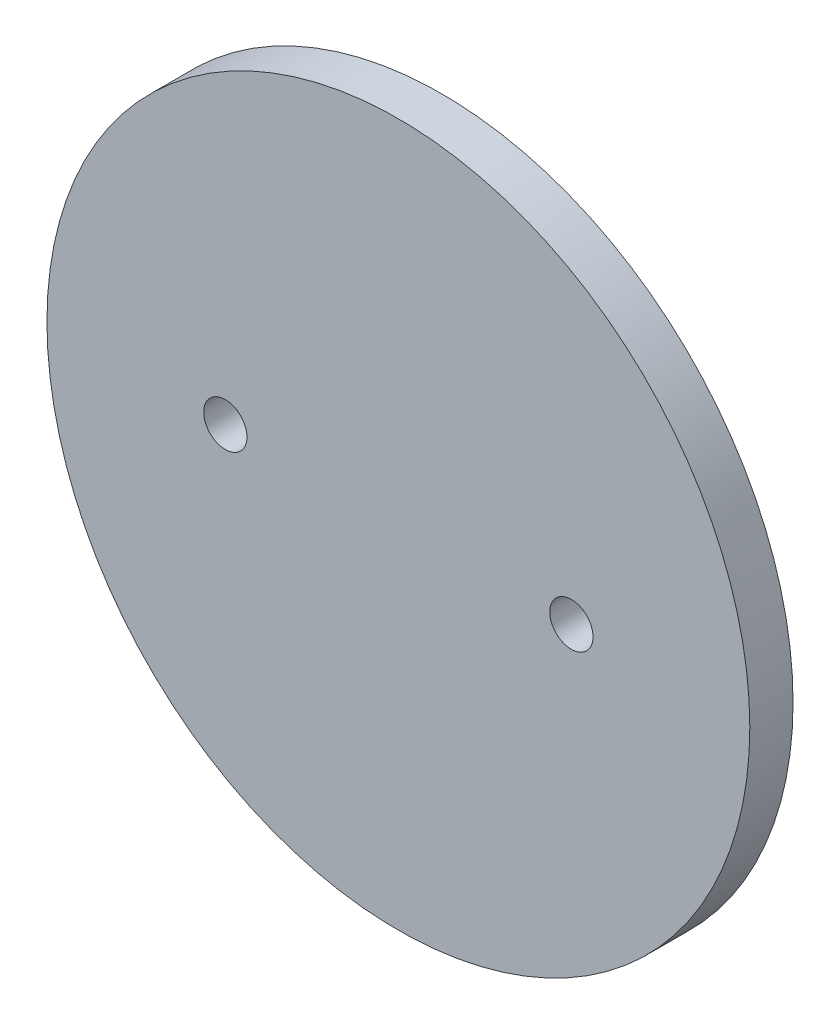
ISO-10303-21;
HEADER;
FILE_DESCRIPTION(('STEP AP214'),'2;1');
FILE_NAME('part.step','',(''),(''),'','','');
FILE_SCHEMA(('AUTOMOTIVE_DESIGN { 1 0 10303 214 1 1 1 1 }'));
ENDSEC;
DATA;
#1=APPLICATION_CONTEXT('core data for automotive mechanical design processes');
#2=APPLICATION_PROTOCOL_DEFINITION('international standard','automotive_design',2000,#1);
#3=PRODUCT_CONTEXT('',#1,'mechanical');
#4=PRODUCT('Part','Part','',(#3));
#5=PRODUCT_RELATED_PRODUCT_CATEGORY('part','',(#4));
#6=PRODUCT_DEFINITION_FORMATION('','',#4);
#7=PRODUCT_DEFINITION_CONTEXT('part definition',#1,'design');
#8=PRODUCT_DEFINITION('design','',#6,#7);
#9=PRODUCT_DEFINITION_SHAPE('','',#8);
#10=(LENGTH_UNIT() NAMED_UNIT(*) SI_UNIT(.MILLI.,.METRE.));
#11=(NAMED_UNIT(*) PLANE_ANGLE_UNIT() SI_UNIT($,.RADIAN.));
#12=(NAMED_UNIT(*) SI_UNIT($,.STERADIAN.) SOLID_ANGLE_UNIT());
#13=UNCERTAINTY_MEASURE_WITH_UNIT(LENGTH_MEASURE(1.E-05),#10,'distance_accuracy_value','');
#14=(GEOMETRIC_REPRESENTATION_CONTEXT(3) GLOBAL_UNCERTAINTY_ASSIGNED_CONTEXT((#13)) GLOBAL_UNIT_ASSIGNED_CONTEXT((#10,
#11,#12)) REPRESENTATION_CONTEXT('',''));
#15=CARTESIAN_POINT('',(0.,0.,0.));
#16=DIRECTION('',(0.,0.,1.));
#17=DIRECTION('',(1.,0.,0.));
#18=AXIS2_PLACEMENT_3D('',#15,#16,#17);
#19=CARTESIAN_POINT('',(0.,0.,2.54));
#20=DIRECTION('',(0.,0.,-1.));
#21=DIRECTION('',(-1.,0.,0.));
#22=AXIS2_PLACEMENT_3D('',#19,#20,#21);
#23=CYLINDRICAL_SURFACE('',#22,20.6375);
#24=CARTESIAN_POINT('',(0.,0.,2.54));
#25=DIRECTION('',(0.,0.,1.));
#26=DIRECTION('',(1.,0.,0.));
#27=AXIS2_PLACEMENT_3D('',#24,#25,#26);
#28=CIRCLE('',#27,20.6375);
#29=CARTESIAN_POINT('',(20.6375,0.,2.54));
#30=VERTEX_POINT('',#29);
#31=EDGE_CURVE('E10',#30,#30,#28,.T.);
#32=ORIENTED_EDGE('',*,*,#31,.F.);
#33=EDGE_LOOP('',(#32));
#34=FACE_BOUND('',#33,.T.);
#35=CARTESIAN_POINT('',(0.,0.,0.));
#36=DIRECTION('',(0.,0.,1.));
#37=DIRECTION('',(1.,0.,0.));
#38=AXIS2_PLACEMENT_3D('',#35,#36,#37);
#39=CIRCLE('',#38,20.6375);
#40=CARTESIAN_POINT('',(20.6375,0.,0.));
#41=VERTEX_POINT('',#40);
#42=EDGE_CURVE('E34',#41,#41,#39,.T.);
#43=ORIENTED_EDGE('',*,*,#42,.T.);
#44=EDGE_LOOP('',(#43));
#45=FACE_BOUND('',#44,.T.);
#46=ADVANCED_FACE('F31',(#34,#45),#23,.T.);
#47=CARTESIAN_POINT('',(0.,0.,2.54));
#48=DIRECTION('',(0.,0.,1.));
#49=DIRECTION('',(1.,0.,0.));
#50=AXIS2_PLACEMENT_3D('',#47,#48,#49);
#51=PLANE('',#50);
#52=CARTESIAN_POINT('',(-10.16,0.,2.54));
#53=DIRECTION('',(0.,0.,1.));
#54=DIRECTION('',(1.,0.,0.));
#55=AXIS2_PLACEMENT_3D('',#52,#53,#54);
#56=CIRCLE('',#55,1.27);
#57=CARTESIAN_POINT('',(-8.89,0.,2.54));
#58=VERTEX_POINT('',#57);
#59=EDGE_CURVE('E49',#58,#58,#56,.T.);
#60=ORIENTED_EDGE('',*,*,#59,.F.);
#61=EDGE_LOOP('',(#60));
#62=FACE_BOUND('',#61,.T.);
#63=CARTESIAN_POINT('',(10.16,0.,2.54));
#64=DIRECTION('',(0.,0.,1.));
#65=DIRECTION('',(1.,0.,0.));
#66=AXIS2_PLACEMENT_3D('',#63,#64,#65);
#67=CIRCLE('',#66,1.27);
#68=CARTESIAN_POINT('',(11.43,0.,2.54));
#69=VERTEX_POINT('',#68);
#70=EDGE_CURVE('E43',#69,#69,#67,.T.);
#71=ORIENTED_EDGE('',*,*,#70,.F.);
#72=EDGE_LOOP('',(#71));
#73=FACE_BOUND('',#72,.T.);
#74=ORIENTED_EDGE('',*,*,#31,.T.);
#75=EDGE_LOOP('',(#74));
#76=FACE_BOUND('',#75,.T.);
#77=ADVANCED_FACE('F65',(#62,#73,#76),#51,.T.);
#78=CARTESIAN_POINT('',(0.,0.,0.));
#79=DIRECTION('',(0.,0.,1.));
#80=DIRECTION('',(1.,0.,0.));
#81=AXIS2_PLACEMENT_3D('',#78,#79,#80);
#82=PLANE('',#81);
#83=CARTESIAN_POINT('',(-10.16,0.,0.));
#84=DIRECTION('',(0.,0.,1.));
#85=DIRECTION('',(1.,0.,0.));
#86=AXIS2_PLACEMENT_3D('',#83,#84,#85);
#87=CIRCLE('',#86,1.27);
#88=CARTESIAN_POINT('',(-8.89,0.,0.));
#89=VERTEX_POINT('',#88);
#90=EDGE_CURVE('E41',#89,#89,#87,.T.);
#91=ORIENTED_EDGE('',*,*,#90,.T.);
#92=EDGE_LOOP('',(#91));
#93=FACE_BOUND('',#92,.T.);
#94=CARTESIAN_POINT('',(10.16,0.,0.));
#95=DIRECTION('',(0.,0.,1.));
#96=DIRECTION('',(1.,0.,0.));
#97=AXIS2_PLACEMENT_3D('',#94,#95,#96);
#98=CIRCLE('',#97,1.27);
#99=CARTESIAN_POINT('',(11.43,0.,0.));
#100=VERTEX_POINT('',#99);
#101=EDGE_CURVE('E46',#100,#100,#98,.T.);
#102=ORIENTED_EDGE('',*,*,#101,.T.);
#103=EDGE_LOOP('',(#102));
#104=FACE_BOUND('',#103,.T.);
#105=ORIENTED_EDGE('',*,*,#42,.F.);
#106=EDGE_LOOP('',(#105));
#107=FACE_BOUND('',#106,.T.);
#108=ADVANCED_FACE('F55',(#93,#104,#107),#82,.F.);
#109=CARTESIAN_POINT('',(10.16,0.,0.));
#110=DIRECTION('',(0.,0.,1.));
#111=DIRECTION('',(1.,0.,0.));
#112=AXIS2_PLACEMENT_3D('',#109,#110,#111);
#113=CYLINDRICAL_SURFACE('',#112,1.27);
#114=ORIENTED_EDGE('',*,*,#101,.F.);
#115=EDGE_LOOP('',(#114));
#116=FACE_BOUND('',#115,.T.);
#117=ORIENTED_EDGE('',*,*,#70,.T.);
#118=EDGE_LOOP('',(#117));
#119=FACE_BOUND('',#118,.T.);
#120=ADVANCED_FACE('F61',(#116,#119),#113,.F.);
#121=CARTESIAN_POINT('',(-10.16,0.,0.));
#122=DIRECTION('',(0.,0.,1.));
#123=DIRECTION('',(1.,0.,0.));
#124=AXIS2_PLACEMENT_3D('',#121,#122,#123);
#125=CYLINDRICAL_SURFACE('',#124,1.27);
#126=ORIENTED_EDGE('',*,*,#90,.F.);
#127=EDGE_LOOP('',(#126));
#128=FACE_BOUND('',#127,.T.);
#129=ORIENTED_EDGE('',*,*,#59,.T.);
#130=EDGE_LOOP('',(#129));
#131=FACE_BOUND('',#130,.T.);
#132=ADVANCED_FACE('F58',(#128,#131),#125,.F.);
#133=CLOSED_SHELL('',(#46,#77,#108,#120,#132));
#134=MANIFOLD_SOLID_BREP('B2',#133);
#135=ADVANCED_BREP_SHAPE_REPRESENTATION('',(#18,#134),#14);
#136=SHAPE_DEFINITION_REPRESENTATION(#9,#135);
ENDSEC;
END-ISO-10303-21;
